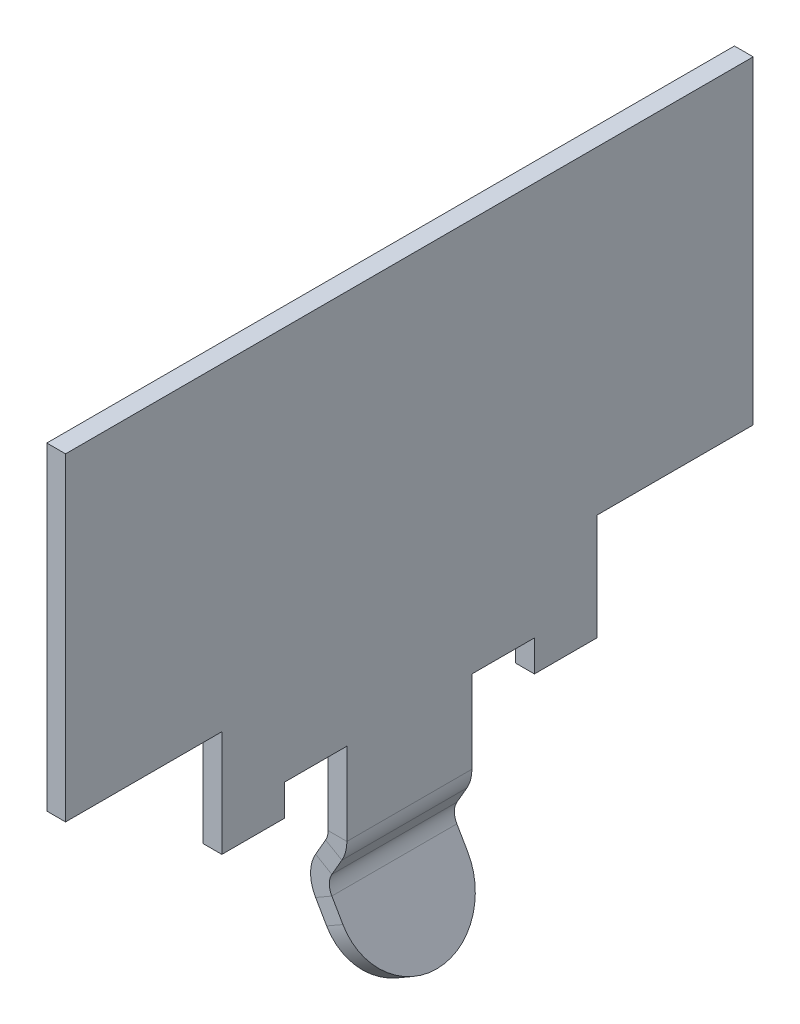
ISO-10303-21;
HEADER;
FILE_DESCRIPTION(('STEP AP214'),'2;1');
FILE_NAME('part.step','',(''),(''),'','','');
FILE_SCHEMA(('AUTOMOTIVE_DESIGN { 1 0 10303 214 1 1 1 1 }'));
ENDSEC;
DATA;
#1=APPLICATION_CONTEXT('core data for automotive mechanical design processes');
#2=APPLICATION_PROTOCOL_DEFINITION('international standard','automotive_design',2000,#1);
#3=PRODUCT_CONTEXT('',#1,'mechanical');
#4=PRODUCT('Part','Part','',(#3));
#5=PRODUCT_RELATED_PRODUCT_CATEGORY('part','',(#4));
#6=PRODUCT_DEFINITION_FORMATION('','',#4);
#7=PRODUCT_DEFINITION_CONTEXT('part definition',#1,'design');
#8=PRODUCT_DEFINITION('design','',#6,#7);
#9=PRODUCT_DEFINITION_SHAPE('','',#8);
#10=(LENGTH_UNIT() NAMED_UNIT(*) SI_UNIT(.MILLI.,.METRE.));
#11=(NAMED_UNIT(*) PLANE_ANGLE_UNIT() SI_UNIT($,.RADIAN.));
#12=(NAMED_UNIT(*) SI_UNIT($,.STERADIAN.) SOLID_ANGLE_UNIT());
#13=UNCERTAINTY_MEASURE_WITH_UNIT(LENGTH_MEASURE(1.E-05),#10,'distance_accuracy_value','');
#14=(GEOMETRIC_REPRESENTATION_CONTEXT(3) GLOBAL_UNCERTAINTY_ASSIGNED_CONTEXT((#13)) GLOBAL_UNIT_ASSIGNED_CONTEXT((#10,
#11,#12)) REPRESENTATION_CONTEXT('',''));
#15=CARTESIAN_POINT('',(0.,0.,0.));
#16=DIRECTION('',(0.,0.,1.));
#17=DIRECTION('',(1.,0.,0.));
#18=AXIS2_PLACEMENT_3D('',#15,#16,#17);
#19=CARTESIAN_POINT('',(4.876794919243,-3.852627944163,0.));
#20=DIRECTION('',(0.866025403784329,0.50000000000019,0.));
#21=DIRECTION('',(0.50000000000019,-0.866025403784329,0.));
#22=AXIS2_PLACEMENT_3D('',#19,#20,#21);
#23=CYLINDRICAL_SURFACE('',#22,1.);
#24=CARTESIAN_POINT('',(4.876794919243,-3.852627944163,0.));
#25=DIRECTION('',(0.866025403784329,0.50000000000019,0.));
#26=DIRECTION('',(0.50000000000019,-0.866025403784329,0.));
#27=AXIS2_PLACEMENT_3D('',#24,#25,#26);
#28=CIRCLE('',#27,1.);
#29=CARTESIAN_POINT('',(5.376794919243,-4.718653347947,0.));
#30=VERTEX_POINT('',#29);
#31=CARTESIAN_POINT('',(4.876794919243,-3.852627944163,-1.));
#32=VERTEX_POINT('',#31);
#33=EDGE_CURVE('E183',#30,#32,#28,.T.);
#34=ORIENTED_EDGE('',*,*,#33,.T.);
#35=DIRECTION('',(0.866025403784329,0.50000000000019,0.));
#36=VECTOR('',#35,1.);
#37=CARTESIAN_POINT('',(4.876794919243,-3.852627944163,-1.));
#38=LINE('',#37,#36);
#39=CARTESIAN_POINT('',(5.136602540378,-3.702627944163,-1.));
#40=VERTEX_POINT('',#39);
#41=EDGE_CURVE('E185',#32,#40,#38,.T.);
#42=ORIENTED_EDGE('',*,*,#41,.T.);
#43=CARTESIAN_POINT('',(5.136602540378,-3.702627944163,0.));
#44=DIRECTION('',(-0.866025403784329,-0.50000000000019,0.));
#45=DIRECTION('',(0.50000000000019,-0.866025403784329,0.));
#46=AXIS2_PLACEMENT_3D('',#43,#44,#45);
#47=CIRCLE('',#46,1.);
#48=CARTESIAN_POINT('',(5.636602540378,-4.568653347947,0.));
#49=VERTEX_POINT('',#48);
#50=EDGE_CURVE('E26',#40,#49,#47,.T.);
#51=ORIENTED_EDGE('',*,*,#50,.T.);
#52=DIRECTION('',(0.866025403784329,0.50000000000019,0.));
#53=VECTOR('',#52,1.);
#54=CARTESIAN_POINT('',(5.376794919243,-4.718653347947,0.));
#55=LINE('',#54,#53);
#56=EDGE_CURVE('E11',#30,#49,#55,.T.);
#57=ORIENTED_EDGE('',*,*,#56,.F.);
#58=EDGE_LOOP('',(#34,#42,#51,#57));
#59=FACE_BOUND('',#58,.T.);
#60=ADVANCED_FACE('F17',(#59),#23,.T.);
#61=CARTESIAN_POINT('',(4.876794919243,-3.852627944163,0.));
#62=DIRECTION('',(0.866025403784329,0.50000000000019,0.));
#63=DIRECTION('',(0.50000000000019,-0.866025403784329,0.));
#64=AXIS2_PLACEMENT_3D('',#61,#62,#63);
#65=CYLINDRICAL_SURFACE('',#64,1.);
#66=ORIENTED_EDGE('',*,*,#56,.T.);
#67=CARTESIAN_POINT('',(5.136602540378,-3.702627944163,0.));
#68=DIRECTION('',(-0.866025403784329,-0.50000000000019,0.));
#69=DIRECTION('',(0.50000000000019,-0.866025403784329,0.));
#70=AXIS2_PLACEMENT_3D('',#67,#68,#69);
#71=CIRCLE('',#70,1.);
#72=CARTESIAN_POINT('',(5.136602540378,-3.702627944163,1.));
#73=VERTEX_POINT('',#72);
#74=EDGE_CURVE('E190',#49,#73,#71,.T.);
#75=ORIENTED_EDGE('',*,*,#74,.T.);
#76=DIRECTION('',(-0.866025403784329,-0.50000000000019,0.));
#77=VECTOR('',#76,1.);
#78=CARTESIAN_POINT('',(4.876794919243,-3.852627944163,1.));
#79=LINE('',#78,#77);
#80=CARTESIAN_POINT('',(4.876794919243,-3.852627944163,1.));
#81=VERTEX_POINT('',#80);
#82=EDGE_CURVE('E206',#73,#81,#79,.T.);
#83=ORIENTED_EDGE('',*,*,#82,.T.);
#84=CARTESIAN_POINT('',(4.876794919243,-3.852627944163,0.));
#85=DIRECTION('',(0.866025403784329,0.50000000000019,0.));
#86=DIRECTION('',(0.50000000000019,-0.866025403784329,0.));
#87=AXIS2_PLACEMENT_3D('',#84,#85,#86);
#88=CIRCLE('',#87,1.);
#89=EDGE_CURVE('E191',#81,#30,#88,.T.);
#90=ORIENTED_EDGE('',*,*,#89,.T.);
#91=EDGE_LOOP('',(#66,#75,#83,#90));
#92=FACE_BOUND('',#91,.T.);
#93=ADVANCED_FACE('F637',(#92),#65,.T.);
#94=CARTESIAN_POINT('',(2.162564434702,1.448557158515,0.));
#95=DIRECTION('',(0.866025403784329,0.50000000000019,0.));
#96=DIRECTION('',(0.,0.,-1.));
#97=AXIS2_PLACEMENT_3D('',#94,#95,#96);
#98=PLANE('',#97);
#99=DIRECTION('',(-0.50000000000019,0.866025403784329,0.));
#100=VECTOR('',#99,1.);
#101=CARTESIAN_POINT('',(4.873205080757,-3.246410161514,-1.));
#102=LINE('',#101,#100);
#103=CARTESIAN_POINT('',(4.959807621135,-3.396410161514,-1.));
#104=VERTEX_POINT('',#103);
#105=EDGE_CURVE('E198',#40,#104,#102,.T.);
#106=ORIENTED_EDGE('',*,*,#105,.T.);
#107=DIRECTION('',(0.,0.,1.));
#108=VECTOR('',#107,1.);
#109=CARTESIAN_POINT('',(4.959807621135,-3.396410161514,-1.));
#110=LINE('',#109,#108);
#111=CARTESIAN_POINT('',(4.959807621135,-3.396410161514,1.));
#112=VERTEX_POINT('',#111);
#113=EDGE_CURVE('E239',#104,#112,#110,.T.);
#114=ORIENTED_EDGE('',*,*,#113,.T.);
#115=DIRECTION('',(0.50000000000019,-0.866025403784329,0.));
#116=VECTOR('',#115,1.);
#117=CARTESIAN_POINT('',(5.636602540378,-4.568653347947,1.));
#118=LINE('',#117,#116);
#119=EDGE_CURVE('E248',#112,#73,#118,.T.);
#120=ORIENTED_EDGE('',*,*,#119,.T.);
#121=ORIENTED_EDGE('',*,*,#74,.F.);
#122=ORIENTED_EDGE('',*,*,#50,.F.);
#123=EDGE_LOOP('',(#106,#114,#120,#121,#122));
#124=FACE_BOUND('',#123,.T.);
#125=ADVANCED_FACE('F641',(#124),#98,.T.);
#126=CARTESIAN_POINT('',(1.902756813566,1.298557158515,0.));
#127=DIRECTION('',(0.866025403784329,0.50000000000019,0.));
#128=DIRECTION('',(0.,0.,-1.));
#129=AXIS2_PLACEMENT_3D('',#126,#127,#128);
#130=PLANE('',#129);
#131=ORIENTED_EDGE('',*,*,#89,.F.);
#132=DIRECTION('',(0.50000000000019,-0.866025403784329,0.));
#133=VECTOR('',#132,1.);
#134=CARTESIAN_POINT('',(1.902756813566,1.298557158515,1.));
#135=LINE('',#134,#133);
#136=CARTESIAN_POINT('',(4.7,-3.546410161514,1.));
#137=VERTEX_POINT('',#136);
#138=EDGE_CURVE('E215',#137,#81,#135,.T.);
#139=ORIENTED_EDGE('',*,*,#138,.F.);
#140=DIRECTION('',(0.,0.,-1.));
#141=VECTOR('',#140,1.);
#142=CARTESIAN_POINT('',(4.7,-3.546410161514,-1.));
#143=LINE('',#142,#141);
#144=CARTESIAN_POINT('',(4.7,-3.546410161514,-1.));
#145=VERTEX_POINT('',#144);
#146=EDGE_CURVE('E203',#137,#145,#143,.T.);
#147=ORIENTED_EDGE('',*,*,#146,.T.);
#148=DIRECTION('',(-0.50000000000019,0.866025403784329,0.));
#149=VECTOR('',#148,1.);
#150=CARTESIAN_POINT('',(1.902756813566,1.298557158515,-1.));
#151=LINE('',#150,#149);
#152=EDGE_CURVE('E196',#32,#145,#151,.T.);
#153=ORIENTED_EDGE('',*,*,#152,.F.);
#154=ORIENTED_EDGE('',*,*,#33,.F.);
#155=EDGE_LOOP('',(#131,#139,#147,#153,#154));
#156=FACE_BOUND('',#155,.T.);
#157=ADVANCED_FACE('F201',(#156),#130,.F.);
#158=CARTESIAN_POINT('',(4.613397459622,-3.396410161514,-1.));
#159=DIRECTION('',(0.,0.,1.));
#160=DIRECTION('',(1.,0.,0.));
#161=AXIS2_PLACEMENT_3D('',#158,#159,#160);
#162=PLANE('',#161);
#163=ORIENTED_EDGE('',*,*,#152,.T.);
#164=DIRECTION('',(-0.866025403784329,-0.50000000000019,0.));
#165=VECTOR('',#164,1.);
#166=CARTESIAN_POINT('',(4.7,-3.546410161514,-1.));
#167=LINE('',#166,#165);
#168=EDGE_CURVE('E225',#104,#145,#167,.T.);
#169=ORIENTED_EDGE('',*,*,#168,.F.);
#170=ORIENTED_EDGE('',*,*,#105,.F.);
#171=ORIENTED_EDGE('',*,*,#41,.F.);
#172=EDGE_LOOP('',(#163,#169,#170,#171));
#173=FACE_BOUND('',#172,.T.);
#174=ADVANCED_FACE('F194',(#173),#162,.F.);
#175=CARTESIAN_POINT('',(5.376794919243,-4.718653347947,1.));
#176=DIRECTION('',(0.,0.,-1.));
#177=DIRECTION('',(0.,-1.,0.));
#178=AXIS2_PLACEMENT_3D('',#175,#176,#177);
#179=PLANE('',#178);
#180=ORIENTED_EDGE('',*,*,#119,.F.);
#181=DIRECTION('',(-0.866025403784329,-0.50000000000019,0.));
#182=VECTOR('',#181,1.);
#183=CARTESIAN_POINT('',(4.959807621135,-3.396410161514,1.));
#184=LINE('',#183,#182);
#185=EDGE_CURVE('E240',#112,#137,#184,.T.);
#186=ORIENTED_EDGE('',*,*,#185,.T.);
#187=ORIENTED_EDGE('',*,*,#138,.T.);
#188=ORIENTED_EDGE('',*,*,#82,.F.);
#189=EDGE_LOOP('',(#180,#186,#187,#188));
#190=FACE_BOUND('',#189,.T.);
#191=ADVANCED_FACE('F652',(#190),#179,.F.);
#192=CARTESIAN_POINT('',(5.219615242271,-3.246410161514,1.));
#193=DIRECTION('',(0.,0.,1.));
#194=DIRECTION('',(-0.866025403784329,-0.50000000000019,0.));
#195=AXIS2_PLACEMENT_3D('',#192,#193,#194);
#196=CYLINDRICAL_SURFACE('',#195,0.3);
#197=DIRECTION('',(0.,0.,-1.));
#198=VECTOR('',#197,1.);
#199=CARTESIAN_POINT('',(4.959807621135,-3.096410161514,1.));
#200=LINE('',#199,#198);
#201=CARTESIAN_POINT('',(4.959807621135,-3.096410161514,1.));
#202=VERTEX_POINT('',#201);
#203=CARTESIAN_POINT('',(4.959807621135,-3.096410161514,-1.));
#204=VERTEX_POINT('',#203);
#205=EDGE_CURVE('E531',#202,#204,#200,.T.);
#206=ORIENTED_EDGE('',*,*,#205,.F.);
#207=CARTESIAN_POINT('',(5.219615242271,-3.246410161514,1.));
#208=DIRECTION('',(0.,0.,-1.));
#209=DIRECTION('',(-1.,0.,0.));
#210=AXIS2_PLACEMENT_3D('',#207,#208,#209);
#211=CIRCLE('',#210,0.3);
#212=EDGE_CURVE('E236',#112,#202,#211,.T.);
#213=ORIENTED_EDGE('',*,*,#212,.F.);
#214=ORIENTED_EDGE('',*,*,#113,.F.);
#215=CARTESIAN_POINT('',(5.219615242271,-3.246410161514,-1.));
#216=DIRECTION('',(0.,0.,1.));
#217=DIRECTION('',(-1.,0.,0.));
#218=AXIS2_PLACEMENT_3D('',#215,#216,#217);
#219=CIRCLE('',#218,0.3);
#220=EDGE_CURVE('E232',#204,#104,#219,.T.);
#221=ORIENTED_EDGE('',*,*,#220,.F.);
#222=EDGE_LOOP('',(#206,#213,#214,#221));
#223=FACE_BOUND('',#222,.T.);
#224=ADVANCED_FACE('F655',(#223),#196,.F.);
#225=CARTESIAN_POINT('',(5.219615242271,-3.246410161514,1.));
#226=DIRECTION('',(0.,0.,1.));
#227=DIRECTION('',(-0.866025403784329,-0.50000000000019,0.));
#228=AXIS2_PLACEMENT_3D('',#225,#226,#227);
#229=CYLINDRICAL_SURFACE('',#228,0.6);
#230=DIRECTION('',(0.,0.,-1.));
#231=VECTOR('',#230,1.);
#232=CARTESIAN_POINT('',(4.7,-2.946410161514,1.));
#233=LINE('',#232,#231);
#234=CARTESIAN_POINT('',(4.7,-2.946410161514,1.));
#235=VERTEX_POINT('',#234);
#236=CARTESIAN_POINT('',(4.7,-2.946410161514,-1.));
#237=VERTEX_POINT('',#236);
#238=EDGE_CURVE('E535',#235,#237,#233,.T.);
#239=ORIENTED_EDGE('',*,*,#238,.T.);
#240=CARTESIAN_POINT('',(5.219615242271,-3.246410161514,-1.));
#241=DIRECTION('',(0.,0.,1.));
#242=DIRECTION('',(-1.,0.,0.));
#243=AXIS2_PLACEMENT_3D('',#240,#241,#242);
#244=CIRCLE('',#243,0.6);
#245=EDGE_CURVE('E229',#237,#145,#244,.T.);
#246=ORIENTED_EDGE('',*,*,#245,.T.);
#247=ORIENTED_EDGE('',*,*,#146,.F.);
#248=CARTESIAN_POINT('',(5.219615242271,-3.246410161514,1.));
#249=DIRECTION('',(0.,0.,-1.));
#250=DIRECTION('',(-1.,0.,0.));
#251=AXIS2_PLACEMENT_3D('',#248,#249,#250);
#252=CIRCLE('',#251,0.6);
#253=EDGE_CURVE('E244',#137,#235,#252,.T.);
#254=ORIENTED_EDGE('',*,*,#253,.T.);
#255=EDGE_LOOP('',(#239,#246,#247,#254));
#256=FACE_BOUND('',#255,.T.);
#257=ADVANCED_FACE('F659',(#256),#229,.T.);
#258=CARTESIAN_POINT('',(5.219615242271,-3.246410161514,1.));
#259=DIRECTION('',(0.,0.,-1.));
#260=DIRECTION('',(0.,-1.,0.));
#261=AXIS2_PLACEMENT_3D('',#258,#259,#260);
#262=PLANE('',#261);
#263=ORIENTED_EDGE('',*,*,#212,.T.);
#264=DIRECTION('',(-0.866025403784329,0.50000000000019,0.));
#265=VECTOR('',#264,1.);
#266=CARTESIAN_POINT('',(4.959807621135,-3.096410161514,1.));
#267=LINE('',#266,#265);
#268=EDGE_CURVE('E563',#202,#235,#267,.T.);
#269=ORIENTED_EDGE('',*,*,#268,.T.);
#270=ORIENTED_EDGE('',*,*,#253,.F.);
#271=ORIENTED_EDGE('',*,*,#185,.F.);
#272=EDGE_LOOP('',(#263,#269,#270,#271));
#273=FACE_BOUND('',#272,.T.);
#274=ADVANCED_FACE('F663',(#273),#262,.F.);
#275=CARTESIAN_POINT('',(5.219615242271,-3.246410161514,-1.));
#276=DIRECTION('',(0.,0.,-1.));
#277=DIRECTION('',(0.,-1.,0.));
#278=AXIS2_PLACEMENT_3D('',#275,#276,#277);
#279=PLANE('',#278);
#280=ORIENTED_EDGE('',*,*,#168,.T.);
#281=ORIENTED_EDGE('',*,*,#245,.F.);
#282=DIRECTION('',(-0.866025403784329,0.50000000000019,0.));
#283=VECTOR('',#282,1.);
#284=CARTESIAN_POINT('',(4.959807621135,-3.096410161514,-1.));
#285=LINE('',#284,#283);
#286=EDGE_CURVE('E224',#204,#237,#285,.T.);
#287=ORIENTED_EDGE('',*,*,#286,.F.);
#288=ORIENTED_EDGE('',*,*,#220,.T.);
#289=EDGE_LOOP('',(#280,#281,#287,#288));
#290=FACE_BOUND('',#289,.T.);
#291=ADVANCED_FACE('F667',(#290),#279,.T.);
#292=CARTESIAN_POINT('',(5.159807621135,-2.75,-1.));
#293=DIRECTION('',(0.,0.,-1.));
#294=DIRECTION('',(0.,-1.,0.));
#295=AXIS2_PLACEMENT_3D('',#292,#293,#294);
#296=PLANE('',#295);
#297=ORIENTED_EDGE('',*,*,#286,.T.);
#298=DIRECTION('',(0.50000000000019,0.866025403784329,0.));
#299=VECTOR('',#298,1.);
#300=CARTESIAN_POINT('',(4.411121593217,-3.446762239272,-1.));
#301=LINE('',#300,#299);
#302=CARTESIAN_POINT('',(4.859807621135,-2.669615242271,-1.));
#303=VERTEX_POINT('',#302);
#304=EDGE_CURVE('E265',#237,#303,#301,.T.);
#305=ORIENTED_EDGE('',*,*,#304,.T.);
#306=DIRECTION('',(0.866025403784329,-0.50000000000019,0.));
#307=VECTOR('',#306,1.);
#308=CARTESIAN_POINT('',(4.859807621135,-2.669615242271,-1.));
#309=LINE('',#308,#307);
#310=CARTESIAN_POINT('',(5.119615242271,-2.819615242271,-1.));
#311=VERTEX_POINT('',#310);
#312=EDGE_CURVE('E221',#303,#311,#309,.T.);
#313=ORIENTED_EDGE('',*,*,#312,.T.);
#314=DIRECTION('',(0.50000000000019,0.866025403784329,0.));
#315=VECTOR('',#314,1.);
#316=CARTESIAN_POINT('',(5.159807621135,-2.75,-1.));
#317=LINE('',#316,#315);
#318=EDGE_CURVE('E528',#204,#311,#317,.T.);
#319=ORIENTED_EDGE('',*,*,#318,.F.);
#320=EDGE_LOOP('',(#297,#305,#313,#319));
#321=FACE_BOUND('',#320,.T.);
#322=ADVANCED_FACE('F671',(#321),#296,.T.);
#323=CARTESIAN_POINT('',(4.6,-2.519615242271,-1.));
#324=DIRECTION('',(0.,0.,-1.));
#325=DIRECTION('',(0.866025403784329,-0.50000000000019,0.));
#326=AXIS2_PLACEMENT_3D('',#323,#324,#325);
#327=CYLINDRICAL_SURFACE('',#326,0.3);
#328=DIRECTION('',(0.,0.,1.));
#329=VECTOR('',#328,1.);
#330=CARTESIAN_POINT('',(4.9,-2.519615242271,-1.));
#331=LINE('',#330,#329);
#332=CARTESIAN_POINT('',(4.9,-2.519615242271,-1.));
#333=VERTEX_POINT('',#332);
#334=CARTESIAN_POINT('',(4.9,-2.519615242271,1.));
#335=VERTEX_POINT('',#334);
#336=EDGE_CURVE('E362',#333,#335,#331,.T.);
#337=ORIENTED_EDGE('',*,*,#336,.F.);
#338=CARTESIAN_POINT('',(4.6,-2.519615242271,-1.));
#339=DIRECTION('',(0.,0.,1.));
#340=DIRECTION('',(1.,0.,0.));
#341=AXIS2_PLACEMENT_3D('',#338,#339,#340);
#342=CIRCLE('',#341,0.3);
#343=EDGE_CURVE('E395',#303,#333,#342,.T.);
#344=ORIENTED_EDGE('',*,*,#343,.F.);
#345=DIRECTION('',(0.,0.,-1.));
#346=VECTOR('',#345,1.);
#347=CARTESIAN_POINT('',(4.859807621135,-2.669615242271,1.));
#348=LINE('',#347,#346);
#349=CARTESIAN_POINT('',(4.859807621135,-2.669615242271,1.));
#350=VERTEX_POINT('',#349);
#351=EDGE_CURVE('E536',#350,#303,#348,.T.);
#352=ORIENTED_EDGE('',*,*,#351,.F.);
#353=CARTESIAN_POINT('',(4.6,-2.519615242271,1.));
#354=DIRECTION('',(0.,0.,-1.));
#355=DIRECTION('',(1.,0.,0.));
#356=AXIS2_PLACEMENT_3D('',#353,#354,#355);
#357=CIRCLE('',#356,0.3);
#358=EDGE_CURVE('E391',#335,#350,#357,.T.);
#359=ORIENTED_EDGE('',*,*,#358,.F.);
#360=EDGE_LOOP('',(#337,#344,#352,#359));
#361=FACE_BOUND('',#360,.T.);
#362=ADVANCED_FACE('F675',(#361),#327,.F.);
#363=CARTESIAN_POINT('',(4.6,-2.519615242271,-1.));
#364=DIRECTION('',(0.,0.,-1.));
#365=DIRECTION('',(0.866025403784329,-0.50000000000019,0.));
#366=AXIS2_PLACEMENT_3D('',#363,#364,#365);
#367=CYLINDRICAL_SURFACE('',#366,0.6);
#368=DIRECTION('',(0.,0.,1.));
#369=VECTOR('',#368,1.);
#370=CARTESIAN_POINT('',(5.2,-2.519615242271,-1.));
#371=LINE('',#370,#369);
#372=CARTESIAN_POINT('',(5.2,-2.519615242271,-1.));
#373=VERTEX_POINT('',#372);
#374=CARTESIAN_POINT('',(5.2,-2.519615242271,1.));
#375=VERTEX_POINT('',#374);
#376=EDGE_CURVE('E315',#373,#375,#371,.T.);
#377=ORIENTED_EDGE('',*,*,#376,.T.);
#378=CARTESIAN_POINT('',(4.6,-2.519615242271,1.));
#379=DIRECTION('',(0.,0.,-1.));
#380=DIRECTION('',(1.,0.,0.));
#381=AXIS2_PLACEMENT_3D('',#378,#379,#380);
#382=CIRCLE('',#381,0.6);
#383=CARTESIAN_POINT('',(5.119615242271,-2.819615242271,1.));
#384=VERTEX_POINT('',#383);
#385=EDGE_CURVE('E366',#375,#384,#382,.T.);
#386=ORIENTED_EDGE('',*,*,#385,.T.);
#387=DIRECTION('',(0.,0.,-1.));
#388=VECTOR('',#387,1.);
#389=CARTESIAN_POINT('',(5.119615242271,-2.819615242271,0.));
#390=LINE('',#389,#388);
#391=EDGE_CURVE('E478',#384,#311,#390,.T.);
#392=ORIENTED_EDGE('',*,*,#391,.T.);
#393=CARTESIAN_POINT('',(4.6,-2.519615242271,-1.));
#394=DIRECTION('',(0.,0.,1.));
#395=DIRECTION('',(1.,0.,0.));
#396=AXIS2_PLACEMENT_3D('',#393,#394,#395);
#397=CIRCLE('',#396,0.6);
#398=EDGE_CURVE('E219',#311,#373,#397,.T.);
#399=ORIENTED_EDGE('',*,*,#398,.T.);
#400=EDGE_LOOP('',(#377,#386,#392,#399));
#401=FACE_BOUND('',#400,.T.);
#402=ADVANCED_FACE('F474',(#401),#367,.T.);
#403=CARTESIAN_POINT('',(4.6,-2.519615242271,-1.));
#404=DIRECTION('',(0.,0.,1.));
#405=DIRECTION('',(1.,0.,0.));
#406=AXIS2_PLACEMENT_3D('',#403,#404,#405);
#407=PLANE('',#406);
#408=ORIENTED_EDGE('',*,*,#343,.T.);
#409=DIRECTION('',(1.,0.,0.));
#410=VECTOR('',#409,1.);
#411=CARTESIAN_POINT('',(4.9,-2.519615242271,-1.));
#412=LINE('',#411,#410);
#413=EDGE_CURVE('E383',#333,#373,#412,.T.);
#414=ORIENTED_EDGE('',*,*,#413,.T.);
#415=ORIENTED_EDGE('',*,*,#398,.F.);
#416=ORIENTED_EDGE('',*,*,#312,.F.);
#417=EDGE_LOOP('',(#408,#414,#415,#416));
#418=FACE_BOUND('',#417,.T.);
#419=ADVANCED_FACE('F485',(#418),#407,.F.);
#420=CARTESIAN_POINT('',(4.6,-2.519615242271,1.));
#421=DIRECTION('',(0.,0.,1.));
#422=DIRECTION('',(1.,0.,0.));
#423=AXIS2_PLACEMENT_3D('',#420,#421,#422);
#424=PLANE('',#423);
#425=DIRECTION('',(0.866025403784329,-0.50000000000019,0.));
#426=VECTOR('',#425,1.);
#427=CARTESIAN_POINT('',(5.119615242271,-2.819615242271,1.));
#428=LINE('',#427,#426);
#429=EDGE_CURVE('E555',#350,#384,#428,.T.);
#430=ORIENTED_EDGE('',*,*,#429,.T.);
#431=ORIENTED_EDGE('',*,*,#385,.F.);
#432=DIRECTION('',(1.,0.,0.));
#433=VECTOR('',#432,1.);
#434=CARTESIAN_POINT('',(4.9,-2.519615242271,1.));
#435=LINE('',#434,#433);
#436=EDGE_CURVE('E399',#335,#375,#435,.T.);
#437=ORIENTED_EDGE('',*,*,#436,.F.);
#438=ORIENTED_EDGE('',*,*,#358,.T.);
#439=EDGE_LOOP('',(#430,#431,#437,#438));
#440=FACE_BOUND('',#439,.T.);
#441=ADVANCED_FACE('F624',(#440),#424,.T.);
#442=CARTESIAN_POINT('',(4.9,0.,0.));
#443=DIRECTION('',(-1.,0.,0.));
#444=DIRECTION('',(0.,0.,1.));
#445=AXIS2_PLACEMENT_3D('',#442,#443,#444);
#446=PLANE('',#445);
#447=DIRECTION('',(0.,1.,0.));
#448=VECTOR('',#447,1.);
#449=CARTESIAN_POINT('',(4.9,0.,5.5));
#450=LINE('',#449,#448);
#451=CARTESIAN_POINT('',(4.9,0.,5.5));
#452=VERTEX_POINT('',#451);
#453=CARTESIAN_POINT('',(4.9,5.1,5.5));
#454=VERTEX_POINT('',#453);
#455=EDGE_CURVE('E271',#452,#454,#450,.T.);
#456=ORIENTED_EDGE('',*,*,#455,.T.);
#457=DIRECTION('',(0.,0.,-1.));
#458=VECTOR('',#457,1.);
#459=CARTESIAN_POINT('',(4.9,5.1,-5.5));
#460=LINE('',#459,#458);
#461=CARTESIAN_POINT('',(4.9,5.1,-5.5));
#462=VERTEX_POINT('',#461);
#463=EDGE_CURVE('E280',#454,#462,#460,.T.);
#464=ORIENTED_EDGE('',*,*,#463,.T.);
#465=DIRECTION('',(0.,-1.,0.));
#466=VECTOR('',#465,1.);
#467=CARTESIAN_POINT('',(4.9,0.,-5.5));
#468=LINE('',#467,#466);
#469=CARTESIAN_POINT('',(4.9,0.,-5.5));
#470=VERTEX_POINT('',#469);
#471=EDGE_CURVE('E290',#462,#470,#468,.T.);
#472=ORIENTED_EDGE('',*,*,#471,.T.);
#473=DIRECTION('',(0.,0.,1.));
#474=VECTOR('',#473,1.);
#475=CARTESIAN_POINT('',(4.9,0.,-5.5));
#476=LINE('',#475,#474);
#477=CARTESIAN_POINT('',(4.9,0.,-3.));
#478=VERTEX_POINT('',#477);
#479=EDGE_CURVE('E310',#470,#478,#476,.T.);
#480=ORIENTED_EDGE('',*,*,#479,.T.);
#481=DIRECTION('',(0.,-1.,0.));
#482=VECTOR('',#481,1.);
#483=CARTESIAN_POINT('',(4.9,-1.7,-3.));
#484=LINE('',#483,#482);
#485=CARTESIAN_POINT('',(4.9,-1.7,-3.));
#486=VERTEX_POINT('',#485);
#487=EDGE_CURVE('E328',#478,#486,#484,.T.);
#488=ORIENTED_EDGE('',*,*,#487,.T.);
#489=DIRECTION('',(0.,0.,1.));
#490=VECTOR('',#489,1.);
#491=CARTESIAN_POINT('',(4.9,-1.7,-3.));
#492=LINE('',#491,#490);
#493=CARTESIAN_POINT('',(4.9,-1.7,-2.));
#494=VERTEX_POINT('',#493);
#495=EDGE_CURVE('E295',#486,#494,#492,.T.);
#496=ORIENTED_EDGE('',*,*,#495,.T.);
#497=DIRECTION('',(0.,1.,0.));
#498=VECTOR('',#497,1.);
#499=CARTESIAN_POINT('',(4.9,-1.7,-2.));
#500=LINE('',#499,#498);
#501=CARTESIAN_POINT('',(4.9,-1.2,-2.));
#502=VERTEX_POINT('',#501);
#503=EDGE_CURVE('E361',#494,#502,#500,.T.);
#504=ORIENTED_EDGE('',*,*,#503,.T.);
#505=DIRECTION('',(0.,0.,1.));
#506=VECTOR('',#505,1.);
#507=CARTESIAN_POINT('',(4.9,-1.2,-1.));
#508=LINE('',#507,#506);
#509=CARTESIAN_POINT('',(4.9,-1.2,-1.));
#510=VERTEX_POINT('',#509);
#511=EDGE_CURVE('E343',#502,#510,#508,.T.);
#512=ORIENTED_EDGE('',*,*,#511,.T.);
#513=DIRECTION('',(0.,-1.,0.));
#514=VECTOR('',#513,1.);
#515=CARTESIAN_POINT('',(4.9,-1.7,-1.));
#516=LINE('',#515,#514);
#517=EDGE_CURVE('E266',#510,#333,#516,.T.);
#518=ORIENTED_EDGE('',*,*,#517,.T.);
#519=ORIENTED_EDGE('',*,*,#336,.T.);
#520=DIRECTION('',(0.,1.,0.));
#521=VECTOR('',#520,1.);
#522=CARTESIAN_POINT('',(4.9,-1.7,1.));
#523=LINE('',#522,#521);
#524=CARTESIAN_POINT('',(4.9,-1.2,1.));
#525=VERTEX_POINT('',#524);
#526=EDGE_CURVE('E387',#335,#525,#523,.T.);
#527=ORIENTED_EDGE('',*,*,#526,.T.);
#528=DIRECTION('',(0.,0.,1.));
#529=VECTOR('',#528,1.);
#530=CARTESIAN_POINT('',(4.9,-1.2,1.));
#531=LINE('',#530,#529);
#532=CARTESIAN_POINT('',(4.9,-1.2,2.));
#533=VERTEX_POINT('',#532);
#534=EDGE_CURVE('E414',#525,#533,#531,.T.);
#535=ORIENTED_EDGE('',*,*,#534,.T.);
#536=DIRECTION('',(0.,-1.,0.));
#537=VECTOR('',#536,1.);
#538=CARTESIAN_POINT('',(4.9,-1.7,2.));
#539=LINE('',#538,#537);
#540=CARTESIAN_POINT('',(4.9,-1.7,2.));
#541=VERTEX_POINT('',#540);
#542=EDGE_CURVE('E352',#533,#541,#539,.T.);
#543=ORIENTED_EDGE('',*,*,#542,.T.);
#544=DIRECTION('',(0.,0.,1.));
#545=VECTOR('',#544,1.);
#546=CARTESIAN_POINT('',(4.9,-1.7,2.));
#547=LINE('',#546,#545);
#548=CARTESIAN_POINT('',(4.9,-1.7,3.));
#549=VERTEX_POINT('',#548);
#550=EDGE_CURVE('E432',#541,#549,#547,.T.);
#551=ORIENTED_EDGE('',*,*,#550,.T.);
#552=DIRECTION('',(0.,1.,0.));
#553=VECTOR('',#552,1.);
#554=CARTESIAN_POINT('',(4.9,-1.7,3.));
#555=LINE('',#554,#553);
#556=CARTESIAN_POINT('',(4.9,0.,3.));
#557=VERTEX_POINT('',#556);
#558=EDGE_CURVE('E444',#549,#557,#555,.T.);
#559=ORIENTED_EDGE('',*,*,#558,.T.);
#560=DIRECTION('',(0.,0.,1.));
#561=VECTOR('',#560,1.);
#562=CARTESIAN_POINT('',(4.9,0.,5.5));
#563=LINE('',#562,#561);
#564=EDGE_CURVE('E316',#557,#452,#563,.T.);
#565=ORIENTED_EDGE('',*,*,#564,.T.);
#566=EDGE_LOOP('',(#456,#464,#472,#480,#488,#496,#504,#512,#518,#519,#527,#535,#543,#551,#559,#565));
#567=FACE_BOUND('',#566,.T.);
#568=ADVANCED_FACE('F626',(#567),#446,.T.);
#569=CARTESIAN_POINT('',(5.2,0.,0.));
#570=DIRECTION('',(-1.,0.,0.));
#571=DIRECTION('',(0.,0.,1.));
#572=AXIS2_PLACEMENT_3D('',#569,#570,#571);
#573=PLANE('',#572);
#574=DIRECTION('',(0.,1.,0.));
#575=VECTOR('',#574,1.);
#576=CARTESIAN_POINT('',(5.2,0.,5.5));
#577=LINE('',#576,#575);
#578=CARTESIAN_POINT('',(5.2,0.,5.5));
#579=VERTEX_POINT('',#578);
#580=CARTESIAN_POINT('',(5.2,5.1,5.5));
#581=VERTEX_POINT('',#580);
#582=EDGE_CURVE('E281',#579,#581,#577,.T.);
#583=ORIENTED_EDGE('',*,*,#582,.F.);
#584=DIRECTION('',(0.,0.,1.));
#585=VECTOR('',#584,1.);
#586=CARTESIAN_POINT('',(5.2,0.,5.5));
#587=LINE('',#586,#585);
#588=CARTESIAN_POINT('',(5.2,0.,3.));
#589=VERTEX_POINT('',#588);
#590=EDGE_CURVE('E311',#589,#579,#587,.T.);
#591=ORIENTED_EDGE('',*,*,#590,.F.);
#592=DIRECTION('',(0.,1.,0.));
#593=VECTOR('',#592,1.);
#594=CARTESIAN_POINT('',(5.2,-1.7,3.));
#595=LINE('',#594,#593);
#596=CARTESIAN_POINT('',(5.2,-1.7,3.));
#597=VERTEX_POINT('',#596);
#598=EDGE_CURVE('E448',#597,#589,#595,.T.);
#599=ORIENTED_EDGE('',*,*,#598,.F.);
#600=DIRECTION('',(0.,0.,1.));
#601=VECTOR('',#600,1.);
#602=CARTESIAN_POINT('',(5.2,-1.7,2.));
#603=LINE('',#602,#601);
#604=CARTESIAN_POINT('',(5.2,-1.7,2.));
#605=VERTEX_POINT('',#604);
#606=EDGE_CURVE('E435',#605,#597,#603,.T.);
#607=ORIENTED_EDGE('',*,*,#606,.F.);
#608=DIRECTION('',(0.,-1.,0.));
#609=VECTOR('',#608,1.);
#610=CARTESIAN_POINT('',(5.2,-1.7,2.));
#611=LINE('',#610,#609);
#612=CARTESIAN_POINT('',(5.2,-1.2,2.));
#613=VERTEX_POINT('',#612);
#614=EDGE_CURVE('E356',#613,#605,#611,.T.);
#615=ORIENTED_EDGE('',*,*,#614,.F.);
#616=DIRECTION('',(0.,0.,1.));
#617=VECTOR('',#616,1.);
#618=CARTESIAN_POINT('',(5.2,-1.2,1.));
#619=LINE('',#618,#617);
#620=CARTESIAN_POINT('',(5.2,-1.2,1.));
#621=VERTEX_POINT('',#620);
#622=EDGE_CURVE('E418',#621,#613,#619,.T.);
#623=ORIENTED_EDGE('',*,*,#622,.F.);
#624=DIRECTION('',(0.,1.,0.));
#625=VECTOR('',#624,1.);
#626=CARTESIAN_POINT('',(5.2,-1.7,1.));
#627=LINE('',#626,#625);
#628=EDGE_CURVE('E403',#375,#621,#627,.T.);
#629=ORIENTED_EDGE('',*,*,#628,.F.);
#630=ORIENTED_EDGE('',*,*,#376,.F.);
#631=DIRECTION('',(0.,-1.,0.));
#632=VECTOR('',#631,1.);
#633=CARTESIAN_POINT('',(5.2,-1.7,-1.));
#634=LINE('',#633,#632);
#635=CARTESIAN_POINT('',(5.2,-1.2,-1.));
#636=VERTEX_POINT('',#635);
#637=EDGE_CURVE('E269',#636,#373,#634,.T.);
#638=ORIENTED_EDGE('',*,*,#637,.F.);
#639=DIRECTION('',(0.,0.,1.));
#640=VECTOR('',#639,1.);
#641=CARTESIAN_POINT('',(5.2,-1.2,-1.));
#642=LINE('',#641,#640);
#643=CARTESIAN_POINT('',(5.2,-1.2,-2.));
#644=VERTEX_POINT('',#643);
#645=EDGE_CURVE('E342',#644,#636,#642,.T.);
#646=ORIENTED_EDGE('',*,*,#645,.F.);
#647=DIRECTION('',(0.,1.,0.));
#648=VECTOR('',#647,1.);
#649=CARTESIAN_POINT('',(5.2,-1.7,-2.));
#650=LINE('',#649,#648);
#651=CARTESIAN_POINT('',(5.2,-1.7,-2.));
#652=VERTEX_POINT('',#651);
#653=EDGE_CURVE('E370',#652,#644,#650,.T.);
#654=ORIENTED_EDGE('',*,*,#653,.F.);
#655=DIRECTION('',(0.,0.,1.));
#656=VECTOR('',#655,1.);
#657=CARTESIAN_POINT('',(5.2,-1.7,-3.));
#658=LINE('',#657,#656);
#659=CARTESIAN_POINT('',(5.2,-1.7,-3.));
#660=VERTEX_POINT('',#659);
#661=EDGE_CURVE('E338',#660,#652,#658,.T.);
#662=ORIENTED_EDGE('',*,*,#661,.F.);
#663=DIRECTION('',(0.,-1.,0.));
#664=VECTOR('',#663,1.);
#665=CARTESIAN_POINT('',(5.2,-1.7,-3.));
#666=LINE('',#665,#664);
#667=CARTESIAN_POINT('',(5.2,0.,-3.));
#668=VERTEX_POINT('',#667);
#669=EDGE_CURVE('E296',#668,#660,#666,.T.);
#670=ORIENTED_EDGE('',*,*,#669,.F.);
#671=DIRECTION('',(0.,0.,1.));
#672=VECTOR('',#671,1.);
#673=CARTESIAN_POINT('',(5.2,0.,-5.5));
#674=LINE('',#673,#672);
#675=CARTESIAN_POINT('',(5.2,0.,-5.5));
#676=VERTEX_POINT('',#675);
#677=EDGE_CURVE('E319',#676,#668,#674,.T.);
#678=ORIENTED_EDGE('',*,*,#677,.F.);
#679=DIRECTION('',(0.,-1.,0.));
#680=VECTOR('',#679,1.);
#681=CARTESIAN_POINT('',(5.2,0.,-5.5));
#682=LINE('',#681,#680);
#683=CARTESIAN_POINT('',(5.2,5.1,-5.5));
#684=VERTEX_POINT('',#683);
#685=EDGE_CURVE('E300',#684,#676,#682,.T.);
#686=ORIENTED_EDGE('',*,*,#685,.F.);
#687=DIRECTION('',(0.,0.,-1.));
#688=VECTOR('',#687,1.);
#689=CARTESIAN_POINT('',(5.2,5.1,-5.5));
#690=LINE('',#689,#688);
#691=EDGE_CURVE('E285',#581,#684,#690,.T.);
#692=ORIENTED_EDGE('',*,*,#691,.F.);
#693=EDGE_LOOP('',(#583,#591,#599,#607,#615,#623,#629,#630,#638,#646,#654,#662,#670,#678,#686,#692));
#694=FACE_BOUND('',#693,.T.);
#695=ADVANCED_FACE('F482',(#694),#573,.F.);
#696=CARTESIAN_POINT('',(5.2,0.,5.5));
#697=DIRECTION('',(0.,1.,0.));
#698=DIRECTION('',(0.,0.,-1.));
#699=AXIS2_PLACEMENT_3D('',#696,#697,#698);
#700=PLANE('',#699);
#701=ORIENTED_EDGE('',*,*,#564,.F.);
#702=DIRECTION('',(-1.,0.,0.));
#703=VECTOR('',#702,1.);
#704=CARTESIAN_POINT('',(5.2,0.,3.));
#705=LINE('',#704,#703);
#706=EDGE_CURVE('E449',#589,#557,#705,.T.);
#707=ORIENTED_EDGE('',*,*,#706,.F.);
#708=ORIENTED_EDGE('',*,*,#590,.T.);
#709=DIRECTION('',(-1.,0.,0.));
#710=VECTOR('',#709,1.);
#711=CARTESIAN_POINT('',(5.2,0.,5.5));
#712=LINE('',#711,#710);
#713=EDGE_CURVE('E275',#579,#452,#712,.T.);
#714=ORIENTED_EDGE('',*,*,#713,.T.);
#715=EDGE_LOOP('',(#701,#707,#708,#714));
#716=FACE_BOUND('',#715,.T.);
#717=ADVANCED_FACE('F719',(#716),#700,.F.);
#718=CARTESIAN_POINT('',(5.2,-1.7,3.));
#719=DIRECTION('',(0.,0.,-1.));
#720=DIRECTION('',(0.,-1.,0.));
#721=AXIS2_PLACEMENT_3D('',#718,#719,#720);
#722=PLANE('',#721);
#723=ORIENTED_EDGE('',*,*,#558,.F.);
#724=DIRECTION('',(-1.,0.,0.));
#725=VECTOR('',#724,1.);
#726=CARTESIAN_POINT('',(5.2,-1.7,3.));
#727=LINE('',#726,#725);
#728=EDGE_CURVE('E440',#597,#549,#727,.T.);
#729=ORIENTED_EDGE('',*,*,#728,.F.);
#730=ORIENTED_EDGE('',*,*,#598,.T.);
#731=ORIENTED_EDGE('',*,*,#706,.T.);
#732=EDGE_LOOP('',(#723,#729,#730,#731));
#733=FACE_BOUND('',#732,.T.);
#734=ADVANCED_FACE('F729',(#733),#722,.F.);
#735=CARTESIAN_POINT('',(5.2,-1.7,2.));
#736=DIRECTION('',(0.,1.,0.));
#737=DIRECTION('',(0.,0.,-1.));
#738=AXIS2_PLACEMENT_3D('',#735,#736,#737);
#739=PLANE('',#738);
#740=ORIENTED_EDGE('',*,*,#550,.F.);
#741=DIRECTION('',(-1.,0.,0.));
#742=VECTOR('',#741,1.);
#743=CARTESIAN_POINT('',(5.2,-1.7,2.));
#744=LINE('',#743,#742);
#745=EDGE_CURVE('E428',#605,#541,#744,.T.);
#746=ORIENTED_EDGE('',*,*,#745,.F.);
#747=ORIENTED_EDGE('',*,*,#606,.T.);
#748=ORIENTED_EDGE('',*,*,#728,.T.);
#749=EDGE_LOOP('',(#740,#746,#747,#748));
#750=FACE_BOUND('',#749,.T.);
#751=ADVANCED_FACE('F739',(#750),#739,.F.);
#752=CARTESIAN_POINT('',(5.2,-1.7,2.));
#753=DIRECTION('',(0.,0.,1.));
#754=DIRECTION('',(1.,0.,0.));
#755=AXIS2_PLACEMENT_3D('',#752,#753,#754);
#756=PLANE('',#755);
#757=ORIENTED_EDGE('',*,*,#542,.F.);
#758=DIRECTION('',(-1.,0.,0.));
#759=VECTOR('',#758,1.);
#760=CARTESIAN_POINT('',(5.2,-1.2,2.));
#761=LINE('',#760,#759);
#762=EDGE_CURVE('E357',#613,#533,#761,.T.);
#763=ORIENTED_EDGE('',*,*,#762,.F.);
#764=ORIENTED_EDGE('',*,*,#614,.T.);
#765=ORIENTED_EDGE('',*,*,#745,.T.);
#766=EDGE_LOOP('',(#757,#763,#764,#765));
#767=FACE_BOUND('',#766,.T.);
#768=ADVANCED_FACE('F750',(#767),#756,.F.);
#769=CARTESIAN_POINT('',(5.2,-1.2,1.));
#770=DIRECTION('',(0.,1.,0.));
#771=DIRECTION('',(0.,0.,-1.));
#772=AXIS2_PLACEMENT_3D('',#769,#770,#771);
#773=PLANE('',#772);
#774=ORIENTED_EDGE('',*,*,#534,.F.);
#775=DIRECTION('',(-1.,0.,0.));
#776=VECTOR('',#775,1.);
#777=CARTESIAN_POINT('',(5.2,-1.2,1.));
#778=LINE('',#777,#776);
#779=EDGE_CURVE('E410',#621,#525,#778,.T.);
#780=ORIENTED_EDGE('',*,*,#779,.F.);
#781=ORIENTED_EDGE('',*,*,#622,.T.);
#782=ORIENTED_EDGE('',*,*,#762,.T.);
#783=EDGE_LOOP('',(#774,#780,#781,#782));
#784=FACE_BOUND('',#783,.T.);
#785=ADVANCED_FACE('F762',(#784),#773,.F.);
#786=CARTESIAN_POINT('',(5.2,-1.7,1.));
#787=DIRECTION('',(0.,0.,-1.));
#788=DIRECTION('',(-1.,0.,0.));
#789=AXIS2_PLACEMENT_3D('',#786,#787,#788);
#790=PLANE('',#789);
#791=ORIENTED_EDGE('',*,*,#526,.F.);
#792=ORIENTED_EDGE('',*,*,#436,.T.);
#793=ORIENTED_EDGE('',*,*,#628,.T.);
#794=ORIENTED_EDGE('',*,*,#779,.T.);
#795=EDGE_LOOP('',(#791,#792,#793,#794));
#796=FACE_BOUND('',#795,.T.);
#797=ADVANCED_FACE('F774',(#796),#790,.F.);
#798=CARTESIAN_POINT('',(5.2,-1.7,-1.));
#799=DIRECTION('',(0.,0.,1.));
#800=DIRECTION('',(1.,0.,0.));
#801=AXIS2_PLACEMENT_3D('',#798,#799,#800);
#802=PLANE('',#801);
#803=ORIENTED_EDGE('',*,*,#517,.F.);
#804=DIRECTION('',(-1.,0.,0.));
#805=VECTOR('',#804,1.);
#806=CARTESIAN_POINT('',(5.2,-1.2,-1.));
#807=LINE('',#806,#805);
#808=EDGE_CURVE('E270',#636,#510,#807,.T.);
#809=ORIENTED_EDGE('',*,*,#808,.F.);
#810=ORIENTED_EDGE('',*,*,#637,.T.);
#811=ORIENTED_EDGE('',*,*,#413,.F.);
#812=EDGE_LOOP('',(#803,#809,#810,#811));
#813=FACE_BOUND('',#812,.T.);
#814=ADVANCED_FACE('F487',(#813),#802,.F.);
#815=CARTESIAN_POINT('',(5.2,-1.2,-1.));
#816=DIRECTION('',(0.,1.,0.));
#817=DIRECTION('',(1.,0.,0.));
#818=AXIS2_PLACEMENT_3D('',#815,#816,#817);
#819=PLANE('',#818);
#820=ORIENTED_EDGE('',*,*,#511,.F.);
#821=DIRECTION('',(-1.,0.,0.));
#822=VECTOR('',#821,1.);
#823=CARTESIAN_POINT('',(5.2,-1.2,-2.));
#824=LINE('',#823,#822);
#825=EDGE_CURVE('E347',#644,#502,#824,.T.);
#826=ORIENTED_EDGE('',*,*,#825,.F.);
#827=ORIENTED_EDGE('',*,*,#645,.T.);
#828=ORIENTED_EDGE('',*,*,#808,.T.);
#829=EDGE_LOOP('',(#820,#826,#827,#828));
#830=FACE_BOUND('',#829,.T.);
#831=ADVANCED_FACE('F490',(#830),#819,.F.);
#832=CARTESIAN_POINT('',(5.2,-1.7,-2.));
#833=DIRECTION('',(0.,0.,-1.));
#834=DIRECTION('',(0.,-1.,0.));
#835=AXIS2_PLACEMENT_3D('',#832,#833,#834);
#836=PLANE('',#835);
#837=ORIENTED_EDGE('',*,*,#503,.F.);
#838=DIRECTION('',(-1.,0.,0.));
#839=VECTOR('',#838,1.);
#840=CARTESIAN_POINT('',(5.2,-1.7,-2.));
#841=LINE('',#840,#839);
#842=EDGE_CURVE('E351',#652,#494,#841,.T.);
#843=ORIENTED_EDGE('',*,*,#842,.F.);
#844=ORIENTED_EDGE('',*,*,#653,.T.);
#845=ORIENTED_EDGE('',*,*,#825,.T.);
#846=EDGE_LOOP('',(#837,#843,#844,#845));
#847=FACE_BOUND('',#846,.T.);
#848=ADVANCED_FACE('F494',(#847),#836,.F.);
#849=CARTESIAN_POINT('',(5.2,-1.7,-3.));
#850=DIRECTION('',(0.,1.,0.));
#851=DIRECTION('',(0.,0.,-1.));
#852=AXIS2_PLACEMENT_3D('',#849,#850,#851);
#853=PLANE('',#852);
#854=ORIENTED_EDGE('',*,*,#495,.F.);
#855=DIRECTION('',(-1.,0.,0.));
#856=VECTOR('',#855,1.);
#857=CARTESIAN_POINT('',(5.2,-1.7,-3.));
#858=LINE('',#857,#856);
#859=EDGE_CURVE('E291',#660,#486,#858,.T.);
#860=ORIENTED_EDGE('',*,*,#859,.F.);
#861=ORIENTED_EDGE('',*,*,#661,.T.);
#862=ORIENTED_EDGE('',*,*,#842,.T.);
#863=EDGE_LOOP('',(#854,#860,#861,#862));
#864=FACE_BOUND('',#863,.T.);
#865=ADVANCED_FACE('F496',(#864),#853,.F.);
#866=CARTESIAN_POINT('',(5.2,-1.7,-3.));
#867=DIRECTION('',(0.,0.,1.));
#868=DIRECTION('',(1.,0.,0.));
#869=AXIS2_PLACEMENT_3D('',#866,#867,#868);
#870=PLANE('',#869);
#871=ORIENTED_EDGE('',*,*,#487,.F.);
#872=DIRECTION('',(-1.,0.,0.));
#873=VECTOR('',#872,1.);
#874=CARTESIAN_POINT('',(5.2,0.,-3.));
#875=LINE('',#874,#873);
#876=EDGE_CURVE('E324',#668,#478,#875,.T.);
#877=ORIENTED_EDGE('',*,*,#876,.F.);
#878=ORIENTED_EDGE('',*,*,#669,.T.);
#879=ORIENTED_EDGE('',*,*,#859,.T.);
#880=EDGE_LOOP('',(#871,#877,#878,#879));
#881=FACE_BOUND('',#880,.T.);
#882=ADVANCED_FACE('F499',(#881),#870,.F.);
#883=CARTESIAN_POINT('',(5.2,0.,-5.5));
#884=DIRECTION('',(0.,1.,0.));
#885=DIRECTION('',(1.,0.,0.));
#886=AXIS2_PLACEMENT_3D('',#883,#884,#885);
#887=PLANE('',#886);
#888=ORIENTED_EDGE('',*,*,#479,.F.);
#889=DIRECTION('',(-1.,0.,0.));
#890=VECTOR('',#889,1.);
#891=CARTESIAN_POINT('',(5.2,0.,-5.5));
#892=LINE('',#891,#890);
#893=EDGE_CURVE('E306',#676,#470,#892,.T.);
#894=ORIENTED_EDGE('',*,*,#893,.F.);
#895=ORIENTED_EDGE('',*,*,#677,.T.);
#896=ORIENTED_EDGE('',*,*,#876,.T.);
#897=EDGE_LOOP('',(#888,#894,#895,#896));
#898=FACE_BOUND('',#897,.T.);
#899=ADVANCED_FACE('F510',(#898),#887,.F.);
#900=CARTESIAN_POINT('',(5.2,0.,-5.5));
#901=DIRECTION('',(0.,0.,1.));
#902=DIRECTION('',(1.,0.,0.));
#903=AXIS2_PLACEMENT_3D('',#900,#901,#902);
#904=PLANE('',#903);
#905=ORIENTED_EDGE('',*,*,#471,.F.);
#906=DIRECTION('',(-1.,0.,0.));
#907=VECTOR('',#906,1.);
#908=CARTESIAN_POINT('',(5.2,5.1,-5.5));
#909=LINE('',#908,#907);
#910=EDGE_CURVE('E286',#684,#462,#909,.T.);
#911=ORIENTED_EDGE('',*,*,#910,.F.);
#912=ORIENTED_EDGE('',*,*,#685,.T.);
#913=ORIENTED_EDGE('',*,*,#893,.T.);
#914=EDGE_LOOP('',(#905,#911,#912,#913));
#915=FACE_BOUND('',#914,.T.);
#916=ADVANCED_FACE('F512',(#915),#904,.F.);
#917=CARTESIAN_POINT('',(5.2,5.1,-5.5));
#918=DIRECTION('',(0.,-1.,0.));
#919=DIRECTION('',(0.,0.,-1.));
#920=AXIS2_PLACEMENT_3D('',#917,#918,#919);
#921=PLANE('',#920);
#922=ORIENTED_EDGE('',*,*,#463,.F.);
#923=DIRECTION('',(-1.,0.,0.));
#924=VECTOR('',#923,1.);
#925=CARTESIAN_POINT('',(5.2,5.1,5.5));
#926=LINE('',#925,#924);
#927=EDGE_CURVE('E276',#581,#454,#926,.T.);
#928=ORIENTED_EDGE('',*,*,#927,.F.);
#929=ORIENTED_EDGE('',*,*,#691,.T.);
#930=ORIENTED_EDGE('',*,*,#910,.T.);
#931=EDGE_LOOP('',(#922,#928,#929,#930));
#932=FACE_BOUND('',#931,.T.);
#933=ADVANCED_FACE('F519',(#932),#921,.F.);
#934=CARTESIAN_POINT('',(5.2,0.,5.5));
#935=DIRECTION('',(0.,0.,-1.));
#936=DIRECTION('',(-1.,0.,0.));
#937=AXIS2_PLACEMENT_3D('',#934,#935,#936);
#938=PLANE('',#937);
#939=ORIENTED_EDGE('',*,*,#455,.F.);
#940=ORIENTED_EDGE('',*,*,#713,.F.);
#941=ORIENTED_EDGE('',*,*,#582,.T.);
#942=ORIENTED_EDGE('',*,*,#927,.T.);
#943=EDGE_LOOP('',(#939,#940,#941,#942));
#944=FACE_BOUND('',#943,.T.);
#945=ADVANCED_FACE('F859',(#944),#938,.F.);
#946=CARTESIAN_POINT('',(4.411121593217,-3.446762239272,0.));
#947=DIRECTION('',(0.866025403784329,-0.50000000000019,0.));
#948=DIRECTION('',(0.,0.,-1.));
#949=AXIS2_PLACEMENT_3D('',#946,#947,#948);
#950=PLANE('',#949);
#951=ORIENTED_EDGE('',*,*,#238,.F.);
#952=DIRECTION('',(-0.50000000000019,-0.866025403784329,0.));
#953=VECTOR('',#952,1.);
#954=CARTESIAN_POINT('',(4.411121593217,-3.446762239272,1.));
#955=LINE('',#954,#953);
#956=EDGE_CURVE('E562',#350,#235,#955,.T.);
#957=ORIENTED_EDGE('',*,*,#956,.F.);
#958=ORIENTED_EDGE('',*,*,#351,.T.);
#959=ORIENTED_EDGE('',*,*,#304,.F.);
#960=EDGE_LOOP('',(#951,#957,#958,#959));
#961=FACE_BOUND('',#960,.T.);
#962=ADVANCED_FACE('F586',(#961),#950,.F.);
#963=CARTESIAN_POINT('',(4.670929214352,-3.596762239272,0.));
#964=DIRECTION('',(0.866025403784329,-0.50000000000019,0.));
#965=DIRECTION('',(0.,0.,-1.));
#966=AXIS2_PLACEMENT_3D('',#963,#964,#965);
#967=PLANE('',#966);
#968=ORIENTED_EDGE('',*,*,#318,.T.);
#969=ORIENTED_EDGE('',*,*,#391,.F.);
#970=DIRECTION('',(-0.50000000000019,-0.866025403784329,0.));
#971=VECTOR('',#970,1.);
#972=CARTESIAN_POINT('',(4.7,-3.546410161514,1.));
#973=LINE('',#972,#971);
#974=EDGE_CURVE('E552',#384,#202,#973,.T.);
#975=ORIENTED_EDGE('',*,*,#974,.T.);
#976=ORIENTED_EDGE('',*,*,#205,.T.);
#977=EDGE_LOOP('',(#968,#969,#975,#976));
#978=FACE_BOUND('',#977,.T.);
#979=ADVANCED_FACE('F622',(#978),#967,.T.);
#980=CARTESIAN_POINT('',(4.7,-3.546410161514,1.));
#981=DIRECTION('',(0.,0.,1.));
#982=DIRECTION('',(1.,0.,0.));
#983=AXIS2_PLACEMENT_3D('',#980,#981,#982);
#984=PLANE('',#983);
#985=ORIENTED_EDGE('',*,*,#974,.F.);
#986=ORIENTED_EDGE('',*,*,#429,.F.);
#987=ORIENTED_EDGE('',*,*,#956,.T.);
#988=ORIENTED_EDGE('',*,*,#268,.F.);
#989=EDGE_LOOP('',(#985,#986,#987,#988));
#990=FACE_BOUND('',#989,.T.);
#991=ADVANCED_FACE('F578',(#990),#984,.T.);
#992=CLOSED_SHELL('',(#60,#93,#125,#157,#174,#191,#224,#257,#274,#291,#322,#362,#402,#419,#441,
#568,#695,#717,#734,#751,#768,#785,#797,#814,#831,#848,#865,#882,#899,#916,#933,#945,#962,#979,#991));
#993=MANIFOLD_SOLID_BREP('B1',#992);
#994=ADVANCED_BREP_SHAPE_REPRESENTATION('',(#18,#993),#14);
#995=SHAPE_DEFINITION_REPRESENTATION(#9,#994);
ENDSEC;
END-ISO-10303-21;
